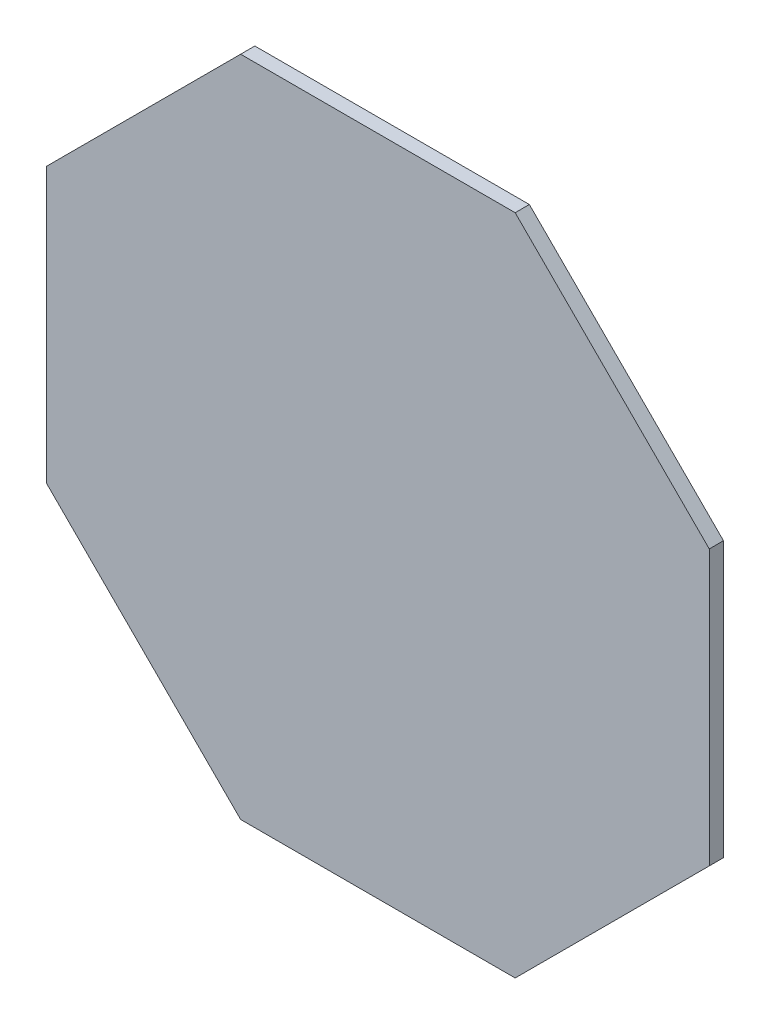
ISO-10303-21;
HEADER;
FILE_DESCRIPTION(('STEP AP214'),'2;1');
FILE_NAME('part.step','',(''),(''),'','','');
FILE_SCHEMA(('AUTOMOTIVE_DESIGN { 1 0 10303 214 1 1 1 1 }'));
ENDSEC;
DATA;
#1=APPLICATION_CONTEXT('core data for automotive mechanical design processes');
#2=APPLICATION_PROTOCOL_DEFINITION('international standard','automotive_design',2000,#1);
#3=PRODUCT_CONTEXT('',#1,'mechanical');
#4=PRODUCT('Part','Part','',(#3));
#5=PRODUCT_RELATED_PRODUCT_CATEGORY('part','',(#4));
#6=PRODUCT_DEFINITION_FORMATION('','',#4);
#7=PRODUCT_DEFINITION_CONTEXT('part definition',#1,'design');
#8=PRODUCT_DEFINITION('design','',#6,#7);
#9=PRODUCT_DEFINITION_SHAPE('','',#8);
#10=(LENGTH_UNIT() NAMED_UNIT(*) SI_UNIT(.MILLI.,.METRE.));
#11=(NAMED_UNIT(*) PLANE_ANGLE_UNIT() SI_UNIT($,.RADIAN.));
#12=(NAMED_UNIT(*) SI_UNIT($,.STERADIAN.) SOLID_ANGLE_UNIT());
#13=UNCERTAINTY_MEASURE_WITH_UNIT(LENGTH_MEASURE(1.E-05),#10,'distance_accuracy_value','');
#14=(GEOMETRIC_REPRESENTATION_CONTEXT(3) GLOBAL_UNCERTAINTY_ASSIGNED_CONTEXT((#13)) GLOBAL_UNIT_ASSIGNED_CONTEXT((#10,
#11,#12)) REPRESENTATION_CONTEXT('',''));
#15=CARTESIAN_POINT('',(0.,0.,0.));
#16=DIRECTION('',(0.,0.,1.));
#17=DIRECTION('',(1.,0.,0.));
#18=AXIS2_PLACEMENT_3D('',#15,#16,#17);
#19=CARTESIAN_POINT('',(35.,-14.4974746830583,1.5));
#20=DIRECTION('',(-1.,0.,0.));
#21=DIRECTION('',(0.,-1.,0.));
#22=AXIS2_PLACEMENT_3D('',#19,#20,#21);
#23=PLANE('',#22);
#24=DIRECTION('',(0.,1.,0.));
#25=VECTOR('',#24,1.);
#26=CARTESIAN_POINT('',(35.,-14.4974746830583,0.));
#27=LINE('',#26,#25);
#28=CARTESIAN_POINT('',(35.,-14.4974746830583,0.));
#29=VERTEX_POINT('',#28);
#30=CARTESIAN_POINT('',(35.,14.4974746830583,0.));
#31=VERTEX_POINT('',#30);
#32=EDGE_CURVE('E144',#29,#31,#27,.T.);
#33=ORIENTED_EDGE('',*,*,#32,.T.);
#34=DIRECTION('',(0.,0.,-1.));
#35=VECTOR('',#34,1.);
#36=CARTESIAN_POINT('',(35.,14.4974746830583,1.5));
#37=LINE('',#36,#35);
#38=CARTESIAN_POINT('',(35.,14.4974746830583,1.5));
#39=VERTEX_POINT('',#38);
#40=EDGE_CURVE('E11',#39,#31,#37,.T.);
#41=ORIENTED_EDGE('',*,*,#40,.F.);
#42=DIRECTION('',(0.,1.,0.));
#43=VECTOR('',#42,1.);
#44=CARTESIAN_POINT('',(35.,-14.4974746830583,1.5));
#45=LINE('',#44,#43);
#46=CARTESIAN_POINT('',(35.,-14.4974746830583,1.5));
#47=VERTEX_POINT('',#46);
#48=EDGE_CURVE('E165',#47,#39,#45,.T.);
#49=ORIENTED_EDGE('',*,*,#48,.F.);
#50=DIRECTION('',(0.,0.,-1.));
#51=VECTOR('',#50,1.);
#52=CARTESIAN_POINT('',(35.,-14.4974746830583,1.5));
#53=LINE('',#52,#51);
#54=EDGE_CURVE('E140',#47,#29,#53,.T.);
#55=ORIENTED_EDGE('',*,*,#54,.T.);
#56=EDGE_LOOP('',(#33,#41,#49,#55));
#57=FACE_BOUND('',#56,.T.);
#58=ADVANCED_FACE('F41',(#57),#23,.F.);
#59=CARTESIAN_POINT('',(35.,14.4974746830583,1.5));
#60=DIRECTION('',(-0.707106781186547,-0.707106781186548,0.));
#61=DIRECTION('',(0.707106781186548,-0.707106781186547,0.));
#62=AXIS2_PLACEMENT_3D('',#59,#60,#61);
#63=PLANE('',#62);
#64=DIRECTION('',(-0.707106781186548,0.707106781186547,0.));
#65=VECTOR('',#64,1.);
#66=CARTESIAN_POINT('',(35.,14.4974746830583,0.));
#67=LINE('',#66,#65);
#68=CARTESIAN_POINT('',(14.4974746830583,35.,0.));
#69=VERTEX_POINT('',#68);
#70=EDGE_CURVE('E147',#31,#69,#67,.T.);
#71=ORIENTED_EDGE('',*,*,#70,.T.);
#72=DIRECTION('',(0.,0.,-1.));
#73=VECTOR('',#72,1.);
#74=CARTESIAN_POINT('',(14.4974746830583,35.,1.5));
#75=LINE('',#74,#73);
#76=CARTESIAN_POINT('',(14.4974746830583,35.,1.5));
#77=VERTEX_POINT('',#76);
#78=EDGE_CURVE('E50',#77,#69,#75,.T.);
#79=ORIENTED_EDGE('',*,*,#78,.F.);
#80=DIRECTION('',(-0.707106781186548,0.707106781186547,0.));
#81=VECTOR('',#80,1.);
#82=CARTESIAN_POINT('',(35.,14.4974746830583,1.5));
#83=LINE('',#82,#81);
#84=EDGE_CURVE('E101',#39,#77,#83,.T.);
#85=ORIENTED_EDGE('',*,*,#84,.F.);
#86=ORIENTED_EDGE('',*,*,#40,.T.);
#87=EDGE_LOOP('',(#71,#79,#85,#86));
#88=FACE_BOUND('',#87,.T.);
#89=ADVANCED_FACE('F210',(#88),#63,.F.);
#90=CARTESIAN_POINT('',(14.4974746830583,35.,1.5));
#91=DIRECTION('',(0.,-1.,0.));
#92=DIRECTION('',(1.,0.,0.));
#93=AXIS2_PLACEMENT_3D('',#90,#91,#92);
#94=PLANE('',#93);
#95=DIRECTION('',(-1.,0.,0.));
#96=VECTOR('',#95,1.);
#97=CARTESIAN_POINT('',(14.4974746830583,35.,0.));
#98=LINE('',#97,#96);
#99=CARTESIAN_POINT('',(-14.4974746830583,35.,0.));
#100=VERTEX_POINT('',#99);
#101=EDGE_CURVE('E150',#69,#100,#98,.T.);
#102=ORIENTED_EDGE('',*,*,#101,.T.);
#103=DIRECTION('',(0.,0.,-1.));
#104=VECTOR('',#103,1.);
#105=CARTESIAN_POINT('',(-14.4974746830583,35.,1.5));
#106=LINE('',#105,#104);
#107=CARTESIAN_POINT('',(-14.4974746830583,35.,1.5));
#108=VERTEX_POINT('',#107);
#109=EDGE_CURVE('E176',#108,#100,#106,.T.);
#110=ORIENTED_EDGE('',*,*,#109,.F.);
#111=DIRECTION('',(-1.,0.,0.));
#112=VECTOR('',#111,1.);
#113=CARTESIAN_POINT('',(14.4974746830583,35.,1.5));
#114=LINE('',#113,#112);
#115=EDGE_CURVE('E185',#77,#108,#114,.T.);
#116=ORIENTED_EDGE('',*,*,#115,.F.);
#117=ORIENTED_EDGE('',*,*,#78,.T.);
#118=EDGE_LOOP('',(#102,#110,#116,#117));
#119=FACE_BOUND('',#118,.T.);
#120=ADVANCED_FACE('F183',(#119),#94,.F.);
#121=CARTESIAN_POINT('',(-14.4974746830583,35.,1.5));
#122=DIRECTION('',(0.707106781186548,-0.707106781186547,0.));
#123=DIRECTION('',(0.707106781186547,0.707106781186548,0.));
#124=AXIS2_PLACEMENT_3D('',#121,#122,#123);
#125=PLANE('',#124);
#126=DIRECTION('',(-0.707106781186547,-0.707106781186548,0.));
#127=VECTOR('',#126,1.);
#128=CARTESIAN_POINT('',(-14.4974746830583,35.,0.));
#129=LINE('',#128,#127);
#130=CARTESIAN_POINT('',(-35.,14.4974746830583,0.));
#131=VERTEX_POINT('',#130);
#132=EDGE_CURVE('E153',#100,#131,#129,.T.);
#133=ORIENTED_EDGE('',*,*,#132,.T.);
#134=DIRECTION('',(0.,0.,-1.));
#135=VECTOR('',#134,1.);
#136=CARTESIAN_POINT('',(-35.,14.4974746830583,1.5));
#137=LINE('',#136,#135);
#138=CARTESIAN_POINT('',(-35.,14.4974746830583,1.5));
#139=VERTEX_POINT('',#138);
#140=EDGE_CURVE('E172',#139,#131,#137,.T.);
#141=ORIENTED_EDGE('',*,*,#140,.F.);
#142=DIRECTION('',(-0.707106781186547,-0.707106781186548,0.));
#143=VECTOR('',#142,1.);
#144=CARTESIAN_POINT('',(-14.4974746830583,35.,1.5));
#145=LINE('',#144,#143);
#146=EDGE_CURVE('E198',#108,#139,#145,.T.);
#147=ORIENTED_EDGE('',*,*,#146,.F.);
#148=ORIENTED_EDGE('',*,*,#109,.T.);
#149=EDGE_LOOP('',(#133,#141,#147,#148));
#150=FACE_BOUND('',#149,.T.);
#151=ADVANCED_FACE('F193',(#150),#125,.F.);
#152=CARTESIAN_POINT('',(-35.,14.4974746830583,1.5));
#153=DIRECTION('',(1.,0.,0.));
#154=DIRECTION('',(0.,1.,0.));
#155=AXIS2_PLACEMENT_3D('',#152,#153,#154);
#156=PLANE('',#155);
#157=DIRECTION('',(0.,-1.,0.));
#158=VECTOR('',#157,1.);
#159=CARTESIAN_POINT('',(-35.,14.4974746830583,0.));
#160=LINE('',#159,#158);
#161=CARTESIAN_POINT('',(-35.,-14.4974746830584,0.));
#162=VERTEX_POINT('',#161);
#163=EDGE_CURVE('E156',#131,#162,#160,.T.);
#164=ORIENTED_EDGE('',*,*,#163,.T.);
#165=DIRECTION('',(0.,0.,-1.));
#166=VECTOR('',#165,1.);
#167=CARTESIAN_POINT('',(-35.,-14.4974746830584,1.5));
#168=LINE('',#167,#166);
#169=CARTESIAN_POINT('',(-35.,-14.4974746830584,1.5));
#170=VERTEX_POINT('',#169);
#171=EDGE_CURVE('E131',#170,#162,#168,.T.);
#172=ORIENTED_EDGE('',*,*,#171,.F.);
#173=DIRECTION('',(0.,-1.,0.));
#174=VECTOR('',#173,1.);
#175=CARTESIAN_POINT('',(-35.,14.4974746830583,1.5));
#176=LINE('',#175,#174);
#177=EDGE_CURVE('E120',#139,#170,#176,.T.);
#178=ORIENTED_EDGE('',*,*,#177,.F.);
#179=ORIENTED_EDGE('',*,*,#140,.T.);
#180=EDGE_LOOP('',(#164,#172,#178,#179));
#181=FACE_BOUND('',#180,.T.);
#182=ADVANCED_FACE('F196',(#181),#156,.F.);
#183=CARTESIAN_POINT('',(-35.,-14.4974746830584,1.5));
#184=DIRECTION('',(0.707106781186547,0.707106781186548,0.));
#185=DIRECTION('',(-0.707106781186548,0.707106781186547,0.));
#186=AXIS2_PLACEMENT_3D('',#183,#184,#185);
#187=PLANE('',#186);
#188=DIRECTION('',(0.707106781186548,-0.707106781186547,0.));
#189=VECTOR('',#188,1.);
#190=CARTESIAN_POINT('',(-35.,-14.4974746830584,0.));
#191=LINE('',#190,#189);
#192=CARTESIAN_POINT('',(-14.4974746830583,-35.,0.));
#193=VERTEX_POINT('',#192);
#194=EDGE_CURVE('E129',#162,#193,#191,.T.);
#195=ORIENTED_EDGE('',*,*,#194,.T.);
#196=DIRECTION('',(0.,0.,-1.));
#197=VECTOR('',#196,1.);
#198=CARTESIAN_POINT('',(-14.4974746830583,-35.,1.5));
#199=LINE('',#198,#197);
#200=CARTESIAN_POINT('',(-14.4974746830583,-35.,1.5));
#201=VERTEX_POINT('',#200);
#202=EDGE_CURVE('E126',#201,#193,#199,.T.);
#203=ORIENTED_EDGE('',*,*,#202,.F.);
#204=DIRECTION('',(0.707106781186548,-0.707106781186547,0.));
#205=VECTOR('',#204,1.);
#206=CARTESIAN_POINT('',(-35.,-14.4974746830584,1.5));
#207=LINE('',#206,#205);
#208=EDGE_CURVE('E114',#170,#201,#207,.T.);
#209=ORIENTED_EDGE('',*,*,#208,.F.);
#210=ORIENTED_EDGE('',*,*,#171,.T.);
#211=EDGE_LOOP('',(#195,#203,#209,#210));
#212=FACE_BOUND('',#211,.T.);
#213=ADVANCED_FACE('F127',(#212),#187,.F.);
#214=CARTESIAN_POINT('',(-14.4974746830583,-35.,1.5));
#215=DIRECTION('',(0.,1.,0.));
#216=DIRECTION('',(-1.,0.,0.));
#217=AXIS2_PLACEMENT_3D('',#214,#215,#216);
#218=PLANE('',#217);
#219=DIRECTION('',(1.,0.,0.));
#220=VECTOR('',#219,1.);
#221=CARTESIAN_POINT('',(-14.4974746830583,-35.,0.));
#222=LINE('',#221,#220);
#223=CARTESIAN_POINT('',(14.4974746830584,-35.,0.));
#224=VERTEX_POINT('',#223);
#225=EDGE_CURVE('E87',#193,#224,#222,.T.);
#226=ORIENTED_EDGE('',*,*,#225,.T.);
#227=DIRECTION('',(0.,0.,-1.));
#228=VECTOR('',#227,1.);
#229=CARTESIAN_POINT('',(14.4974746830584,-35.,1.5));
#230=LINE('',#229,#228);
#231=CARTESIAN_POINT('',(14.4974746830584,-35.,1.5));
#232=VERTEX_POINT('',#231);
#233=EDGE_CURVE('E132',#232,#224,#230,.T.);
#234=ORIENTED_EDGE('',*,*,#233,.F.);
#235=DIRECTION('',(1.,0.,0.));
#236=VECTOR('',#235,1.);
#237=CARTESIAN_POINT('',(-14.4974746830583,-35.,1.5));
#238=LINE('',#237,#236);
#239=EDGE_CURVE('E118',#201,#232,#238,.T.);
#240=ORIENTED_EDGE('',*,*,#239,.F.);
#241=ORIENTED_EDGE('',*,*,#202,.T.);
#242=EDGE_LOOP('',(#226,#234,#240,#241));
#243=FACE_BOUND('',#242,.T.);
#244=ADVANCED_FACE('F134',(#243),#218,.F.);
#245=CARTESIAN_POINT('',(14.4974746830584,-35.,1.5));
#246=DIRECTION('',(-0.707106781186548,0.707106781186547,0.));
#247=DIRECTION('',(-0.707106781186547,-0.707106781186548,0.));
#248=AXIS2_PLACEMENT_3D('',#245,#246,#247);
#249=PLANE('',#248);
#250=DIRECTION('',(0.707106781186547,0.707106781186548,0.));
#251=VECTOR('',#250,1.);
#252=CARTESIAN_POINT('',(14.4974746830584,-35.,0.));
#253=LINE('',#252,#251);
#254=EDGE_CURVE('E93',#224,#29,#253,.T.);
#255=ORIENTED_EDGE('',*,*,#254,.T.);
#256=ORIENTED_EDGE('',*,*,#54,.F.);
#257=DIRECTION('',(0.707106781186547,0.707106781186548,0.));
#258=VECTOR('',#257,1.);
#259=CARTESIAN_POINT('',(14.4974746830584,-35.,1.5));
#260=LINE('',#259,#258);
#261=EDGE_CURVE('E58',#232,#47,#260,.T.);
#262=ORIENTED_EDGE('',*,*,#261,.F.);
#263=ORIENTED_EDGE('',*,*,#233,.T.);
#264=EDGE_LOOP('',(#255,#256,#262,#263));
#265=FACE_BOUND('',#264,.T.);
#266=ADVANCED_FACE('F226',(#265),#249,.F.);
#267=CARTESIAN_POINT('',(0.,0.,1.5));
#268=DIRECTION('',(0.,0.,1.));
#269=DIRECTION('',(1.,0.,0.));
#270=AXIS2_PLACEMENT_3D('',#267,#268,#269);
#271=PLANE('',#270);
#272=ORIENTED_EDGE('',*,*,#48,.T.);
#273=ORIENTED_EDGE('',*,*,#84,.T.);
#274=ORIENTED_EDGE('',*,*,#115,.T.);
#275=ORIENTED_EDGE('',*,*,#146,.T.);
#276=ORIENTED_EDGE('',*,*,#177,.T.);
#277=ORIENTED_EDGE('',*,*,#208,.T.);
#278=ORIENTED_EDGE('',*,*,#239,.T.);
#279=ORIENTED_EDGE('',*,*,#261,.T.);
#280=EDGE_LOOP('',(#272,#273,#274,#275,#276,#277,#278,#279));
#281=FACE_BOUND('',#280,.T.);
#282=ADVANCED_FACE('F116',(#281),#271,.T.);
#283=CARTESIAN_POINT('',(0.,0.,0.));
#284=DIRECTION('',(0.,0.,1.));
#285=DIRECTION('',(1.,0.,0.));
#286=AXIS2_PLACEMENT_3D('',#283,#284,#285);
#287=PLANE('',#286);
#288=ORIENTED_EDGE('',*,*,#32,.F.);
#289=ORIENTED_EDGE('',*,*,#254,.F.);
#290=ORIENTED_EDGE('',*,*,#225,.F.);
#291=ORIENTED_EDGE('',*,*,#194,.F.);
#292=ORIENTED_EDGE('',*,*,#163,.F.);
#293=ORIENTED_EDGE('',*,*,#132,.F.);
#294=ORIENTED_EDGE('',*,*,#101,.F.);
#295=ORIENTED_EDGE('',*,*,#70,.F.);
#296=EDGE_LOOP('',(#288,#289,#290,#291,#292,#293,#294,#295));
#297=FACE_BOUND('',#296,.T.);
#298=ADVANCED_FACE('F189',(#297),#287,.F.);
#299=CLOSED_SHELL('',(#58,#89,#120,#151,#182,#213,#244,#266,#282,#298));
#300=MANIFOLD_SOLID_BREP('B2',#299);
#301=ADVANCED_BREP_SHAPE_REPRESENTATION('',(#18,#300),#14);
#302=SHAPE_DEFINITION_REPRESENTATION(#9,#301);
ENDSEC;
END-ISO-10303-21;
